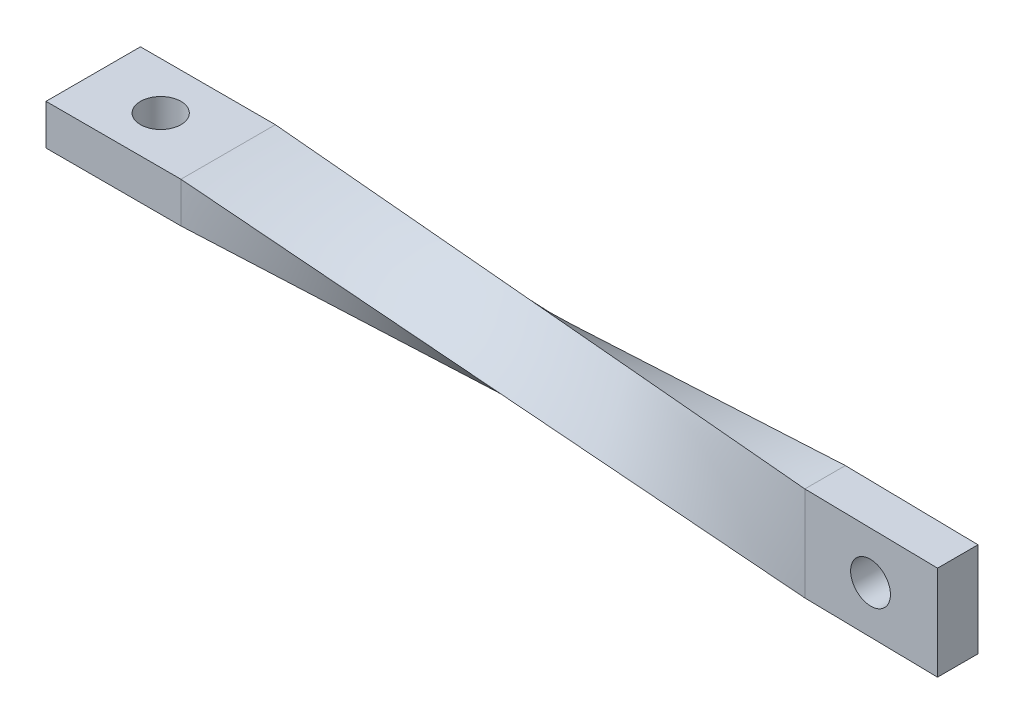
ISO-10303-21;
HEADER;
FILE_DESCRIPTION(('STEP AP214'),'2;1');
FILE_NAME('part.step','',(''),(''),'','','');
FILE_SCHEMA(('AUTOMOTIVE_DESIGN { 1 0 10303 214 1 1 1 1 }'));
ENDSEC;
DATA;
#1=APPLICATION_CONTEXT('core data for automotive mechanical design processes');
#2=APPLICATION_PROTOCOL_DEFINITION('international standard','automotive_design',2000,#1);
#3=PRODUCT_CONTEXT('',#1,'mechanical');
#4=PRODUCT('Part','Part','',(#3));
#5=PRODUCT_RELATED_PRODUCT_CATEGORY('part','',(#4));
#6=PRODUCT_DEFINITION_FORMATION('','',#4);
#7=PRODUCT_DEFINITION_CONTEXT('part definition',#1,'design');
#8=PRODUCT_DEFINITION('design','',#6,#7);
#9=PRODUCT_DEFINITION_SHAPE('','',#8);
#10=(LENGTH_UNIT() NAMED_UNIT(*) SI_UNIT(.MILLI.,.METRE.));
#11=(NAMED_UNIT(*) PLANE_ANGLE_UNIT() SI_UNIT($,.RADIAN.));
#12=(NAMED_UNIT(*) SI_UNIT($,.STERADIAN.) SOLID_ANGLE_UNIT());
#13=UNCERTAINTY_MEASURE_WITH_UNIT(LENGTH_MEASURE(1.E-05),#10,'distance_accuracy_value','');
#14=(GEOMETRIC_REPRESENTATION_CONTEXT(3) GLOBAL_UNCERTAINTY_ASSIGNED_CONTEXT((#13)) GLOBAL_UNIT_ASSIGNED_CONTEXT((#10,
#11,#12)) REPRESENTATION_CONTEXT('',''));
#15=CARTESIAN_POINT('',(0.,0.,0.));
#16=DIRECTION('',(0.,0.,1.));
#17=DIRECTION('',(1.,0.,0.));
#18=AXIS2_PLACEMENT_3D('',#15,#16,#17);
#19=CARTESIAN_POINT('',(54.9922111222972,0.,0.168288995891755));
#20=DIRECTION('',(1.,0.,0.));
#21=DIRECTION('',(0.,0.,-1.));
#22=AXIS2_PLACEMENT_3D('',#19,#20,#21);
#23=PLANE('',#22);
#24=DIRECTION('',(0.,0.,-1.));
#25=VECTOR('',#24,1.);
#26=CARTESIAN_POINT('',(54.9922111222973,3.5,2.42558947740465));
#27=LINE('',#26,#25);
#28=CARTESIAN_POINT('',(54.9922111222973,3.5,2.42558947740465));
#29=VERTEX_POINT('',#28);
#30=CARTESIAN_POINT('',(54.9922111222973,3.5,-0.57441052259535));
#31=VERTEX_POINT('',#30);
#32=EDGE_CURVE('E86',#29,#31,#27,.T.);
#33=ORIENTED_EDGE('',*,*,#32,.F.);
#34=DIRECTION('',(0.,-1.,0.));
#35=VECTOR('',#34,1.);
#36=CARTESIAN_POINT('',(54.9922111222973,3.5,2.42558947740465));
#37=LINE('',#36,#35);
#38=CARTESIAN_POINT('',(54.9922111222973,-3.5,2.42558947740465));
#39=VERTEX_POINT('',#38);
#40=EDGE_CURVE('E106',#29,#39,#37,.T.);
#41=ORIENTED_EDGE('',*,*,#40,.T.);
#42=DIRECTION('',(0.,0.,-1.));
#43=VECTOR('',#42,1.);
#44=CARTESIAN_POINT('',(54.9922111222973,-3.5,2.42558947740465));
#45=LINE('',#44,#43);
#46=CARTESIAN_POINT('',(54.9922111222973,-3.5,-0.57441052259535));
#47=VERTEX_POINT('',#46);
#48=EDGE_CURVE('E324',#39,#47,#45,.T.);
#49=ORIENTED_EDGE('',*,*,#48,.T.);
#50=DIRECTION('',(0.,-1.,0.));
#51=VECTOR('',#50,1.);
#52=CARTESIAN_POINT('',(54.9922111222973,3.5,-0.57441052259535));
#53=LINE('',#52,#51);
#54=EDGE_CURVE('E304',#31,#47,#53,.T.);
#55=ORIENTED_EDGE('',*,*,#54,.F.);
#56=EDGE_LOOP('',(#33,#41,#49,#55));
#57=FACE_BOUND('',#56,.T.);
#58=ADVANCED_FACE('F76',(#57),#23,.T.);
#59=CARTESIAN_POINT('',(44.9936272818796,3.5,2.2573004815129));
#60=DIRECTION('',(-0.0168288995891755,0.,0.999858384041769));
#61=DIRECTION('',(0.999858384041769,0.,0.0168288995891755));
#62=AXIS2_PLACEMENT_3D('',#59,#60,#61);
#63=PLANE('',#62);
#64=CARTESIAN_POINT('',(49.9424396530432,0.,2.34059534387463));
#65=DIRECTION('',(-0.0168288995891755,0.,0.999858384041769));
#66=DIRECTION('',(0.999858384041769,0.,0.0168288995891755));
#67=AXIS2_PLACEMENT_3D('',#64,#65,#66);
#68=CIRCLE('',#67,1.5);
#69=CARTESIAN_POINT('',(51.4422272291058,0.,2.36583869325839));
#70=VERTEX_POINT('',#69);
#71=EDGE_CURVE('E177',#70,#70,#68,.F.);
#72=ORIENTED_EDGE('',*,*,#71,.T.);
#73=EDGE_LOOP('',(#72));
#74=FACE_BOUND('',#73,.T.);
#75=ORIENTED_EDGE('',*,*,#40,.F.);
#76=DIRECTION('',(0.999858384041769,0.,0.0168288995891755));
#77=VECTOR('',#76,1.);
#78=CARTESIAN_POINT('',(44.9936272818796,3.5,2.2573004815129));
#79=LINE('',#78,#77);
#80=CARTESIAN_POINT('',(44.9936272818796,3.5,2.2573004815129));
#81=VERTEX_POINT('',#80);
#82=EDGE_CURVE('E295',#81,#29,#79,.T.);
#83=ORIENTED_EDGE('',*,*,#82,.F.);
#84=CARTESIAN_POINT('',(44.9936272818796,-3.5,2.2573004815129));
#85=CARTESIAN_POINT('',(44.9936272818796,-1.16666666666667,2.2573004815129));
#86=CARTESIAN_POINT('',(44.9936272818796,1.16666666666667,2.2573004815129));
#87=CARTESIAN_POINT('',(44.9936272818796,3.5,2.2573004815129));
#88=B_SPLINE_CURVE_WITH_KNOTS('',3,(#84,#85,#86,#87),.UNSPECIFIED.,.F.,.F.,(4,4),(0.,1.),.UNSPECIFIED.);
#89=CARTESIAN_POINT('',(44.9936272818796,-3.5,2.2573004815129));
#90=VERTEX_POINT('',#89);
#91=EDGE_CURVE('E297',#81,#90,#88,.F.);
#92=ORIENTED_EDGE('',*,*,#91,.T.);
#93=DIRECTION('',(0.999858384041769,0.,0.0168288995891755));
#94=VECTOR('',#93,1.);
#95=CARTESIAN_POINT('',(44.9936272818796,-3.5,2.2573004815129));
#96=LINE('',#95,#94);
#97=EDGE_CURVE('E326',#90,#39,#96,.T.);
#98=ORIENTED_EDGE('',*,*,#97,.T.);
#99=EDGE_LOOP('',(#75,#83,#92,#98));
#100=FACE_BOUND('',#99,.T.);
#101=ADVANCED_FACE('F211',(#74,#100),#63,.T.);
#102=CARTESIAN_POINT('',(44.9936272818796,-3.5,2.2573004815129));
#103=DIRECTION('',(0.,-1.,0.));
#104=DIRECTION('',(0.,0.,-1.));
#105=AXIS2_PLACEMENT_3D('',#102,#103,#104);
#106=PLANE('',#105);
#107=ORIENTED_EDGE('',*,*,#48,.F.);
#108=ORIENTED_EDGE('',*,*,#97,.F.);
#109=CARTESIAN_POINT('',(44.9936272818796,-3.5,-0.742699518487104));
#110=CARTESIAN_POINT('',(44.9936272818796,-3.5,0.257300481512896));
#111=CARTESIAN_POINT('',(44.9936272818796,-3.5,1.2573004815129));
#112=CARTESIAN_POINT('',(44.9936272818796,-3.5,2.2573004815129));
#113=B_SPLINE_CURVE_WITH_KNOTS('',3,(#109,#110,#111,#112),.UNSPECIFIED.,.F.,.F.,(4,4),(0.,1.),.UNSPECIFIED.);
#114=CARTESIAN_POINT('',(44.9936272818796,-3.5,-0.742699518487104));
#115=VERTEX_POINT('',#114);
#116=EDGE_CURVE('E321',#90,#115,#113,.F.);
#117=ORIENTED_EDGE('',*,*,#116,.T.);
#118=DIRECTION('',(0.999858384041769,0.,0.0168288995891755));
#119=VECTOR('',#118,1.);
#120=CARTESIAN_POINT('',(44.9936272818796,-3.5,-0.742699518487104));
#121=LINE('',#120,#119);
#122=EDGE_CURVE('E316',#115,#47,#121,.T.);
#123=ORIENTED_EDGE('',*,*,#122,.T.);
#124=EDGE_LOOP('',(#107,#108,#117,#123));
#125=FACE_BOUND('',#124,.T.);
#126=ADVANCED_FACE('F362',(#125),#106,.T.);
#127=CARTESIAN_POINT('',(44.9936272818796,3.5,2.2573004815129));
#128=DIRECTION('',(0.,-1.,0.));
#129=DIRECTION('',(0.,0.,-1.));
#130=AXIS2_PLACEMENT_3D('',#127,#128,#129);
#131=PLANE('',#130);
#132=ORIENTED_EDGE('',*,*,#32,.T.);
#133=DIRECTION('',(0.999858384041769,0.,0.0168288995891755));
#134=VECTOR('',#133,1.);
#135=CARTESIAN_POINT('',(44.9936272818796,3.5,-0.742699518487104));
#136=LINE('',#135,#134);
#137=CARTESIAN_POINT('',(44.9936272818796,3.5,-0.742699518487104));
#138=VERTEX_POINT('',#137);
#139=EDGE_CURVE('E300',#138,#31,#136,.T.);
#140=ORIENTED_EDGE('',*,*,#139,.F.);
#141=CARTESIAN_POINT('',(44.9936272818796,3.5,2.2573004815129));
#142=CARTESIAN_POINT('',(44.9936272818796,3.5,1.2573004815129));
#143=CARTESIAN_POINT('',(44.9936272818796,3.5,0.257300481512896));
#144=CARTESIAN_POINT('',(44.9936272818796,3.5,-0.742699518487104));
#145=B_SPLINE_CURVE_WITH_KNOTS('',3,(#141,#142,#143,#144),.UNSPECIFIED.,.F.,.F.,(4,4),(0.,1.),.UNSPECIFIED.);
#146=EDGE_CURVE('E13',#81,#138,#145,.T.);
#147=ORIENTED_EDGE('',*,*,#146,.F.);
#148=ORIENTED_EDGE('',*,*,#82,.T.);
#149=EDGE_LOOP('',(#132,#140,#147,#148));
#150=FACE_BOUND('',#149,.T.);
#151=ADVANCED_FACE('F352',(#150),#131,.F.);
#152=CARTESIAN_POINT('',(44.9936272818796,3.5,-0.742699518487104));
#153=DIRECTION('',(-0.0168288995891755,0.,0.999858384041769));
#154=DIRECTION('',(0.999858384041769,0.,0.0168288995891755));
#155=AXIS2_PLACEMENT_3D('',#152,#153,#154);
#156=PLANE('',#155);
#157=CARTESIAN_POINT('',(49.9929192020885,0.,-0.658555020541228));
#158=DIRECTION('',(0.0168288995891755,0.,-0.999858384041769));
#159=DIRECTION('',(-0.999858384041769,0.,-0.0168288995891755));
#160=AXIS2_PLACEMENT_3D('',#157,#158,#159);
#161=CIRCLE('',#160,1.5);
#162=CARTESIAN_POINT('',(48.4931316260258,0.,-0.683798369924991));
#163=VERTEX_POINT('',#162);
#164=EDGE_CURVE('E174',#163,#163,#161,.T.);
#165=ORIENTED_EDGE('',*,*,#164,.F.);
#166=EDGE_LOOP('',(#165));
#167=FACE_BOUND('',#166,.T.);
#168=ORIENTED_EDGE('',*,*,#54,.T.);
#169=ORIENTED_EDGE('',*,*,#122,.F.);
#170=CARTESIAN_POINT('',(44.9936272818796,3.5,-0.742699518487105));
#171=CARTESIAN_POINT('',(44.9936272818796,1.16666666666667,-0.742699518487105));
#172=CARTESIAN_POINT('',(44.9936272818796,-1.16666666666667,-0.742699518487105));
#173=CARTESIAN_POINT('',(44.9936272818796,-3.5,-0.742699518487105));
#174=B_SPLINE_CURVE_WITH_KNOTS('',3,(#170,#171,#172,#173),.UNSPECIFIED.,.F.,.F.,(4,4),(0.,1.),.UNSPECIFIED.);
#175=EDGE_CURVE('E303',#138,#115,#174,.T.);
#176=ORIENTED_EDGE('',*,*,#175,.F.);
#177=ORIENTED_EDGE('',*,*,#139,.T.);
#178=EDGE_LOOP('',(#168,#169,#176,#177));
#179=FACE_BOUND('',#178,.T.);
#180=ADVANCED_FACE('F361',(#167,#179),#156,.F.);
#181=CARTESIAN_POINT('',(0.,1.5,-3.5));
#182=CARTESIAN_POINT('',(14.9978757606265,2.16666666666667,-1.5808998394957));
#183=CARTESIAN_POINT('',(29.9957515212531,2.83333333333333,0.338200321008597));
#184=CARTESIAN_POINT('',(44.9936272818796,3.5,2.2573004815129));
#185=CARTESIAN_POINT('',(0.,1.5,-1.16666666666667));
#186=CARTESIAN_POINT('',(14.9978757606265,1.38888888888889,-0.0253442839401462));
#187=CARTESIAN_POINT('',(29.9957515212531,1.27777777777778,1.11597809878637));
#188=CARTESIAN_POINT('',(44.9936272818796,1.16666666666667,2.2573004815129));
#189=CARTESIAN_POINT('',(0.,1.5,1.16666666666667));
#190=CARTESIAN_POINT('',(14.9978757606265,0.611111111111111,1.53021127161541));
#191=CARTESIAN_POINT('',(29.9957515212531,-0.277777777777778,1.89375587656415));
#192=CARTESIAN_POINT('',(44.9936272818796,-1.16666666666667,2.2573004815129));
#193=CARTESIAN_POINT('',(0.,1.5,3.5));
#194=CARTESIAN_POINT('',(14.9978757606265,-0.166666666666667,3.08576682717097));
#195=CARTESIAN_POINT('',(29.9957515212531,-1.83333333333333,2.67153365434193));
#196=CARTESIAN_POINT('',(44.9936272818796,-3.5,2.2573004815129));
#197=B_SPLINE_SURFACE_WITH_KNOTS('',3,3,((#181,#182,#183,#184),(#185,#186,#187,#188),(#189,#190,
#191,#192),(#193,#194,#195,#196)),.UNSPECIFIED.,.F.,.F.,.F.,(4,4),(4,4),(0.,1.),(0.,1.),.UNSPECIFIED.);
#198=DIRECTION('',(0.,0.,1.));
#199=VECTOR('',#198,1.);
#200=CARTESIAN_POINT('',(0.,1.5,3.5));
#201=LINE('',#200,#199);
#202=CARTESIAN_POINT('',(0.,1.5,-3.5));
#203=VERTEX_POINT('',#202);
#204=CARTESIAN_POINT('',(0.,1.5,3.5));
#205=VERTEX_POINT('',#204);
#206=EDGE_CURVE('E289',#203,#205,#201,.T.);
#207=DIRECTION('',(0.993507769932282,-0.110405387379426,-0.0274401443469589));
#208=VECTOR('',#207,1.);
#209=CARTESIAN_POINT('',(22.4968136409398,-1.,2.87865024075645));
#210=LINE('',#209,#208);
#211=EDGE_CURVE('E94',#205,#90,#210,.T.);
#212=DIRECTION('',(-0.990949783292485,-0.044048450554311,-0.126800082793116));
#213=VECTOR('',#212,1.);
#214=CARTESIAN_POINT('',(22.4968136409398,2.5,-0.621349759243553));
#215=LINE('',#214,#213);
#216=EDGE_CURVE('E245',#81,#203,#215,.T.);
#217=ORIENTED_EDGE('',*,*,#206,.T.);
#218=ORIENTED_EDGE('',*,*,#211,.T.);
#219=ORIENTED_EDGE('',*,*,#91,.F.);
#220=ORIENTED_EDGE('',*,*,#216,.T.);
#221=EDGE_LOOP('',(#217,#218,#219,#220));
#222=FACE_BOUND('',#221,.T.);
#223=ADVANCED_FACE('F365',(#222),#197,.T.);
#224=CARTESIAN_POINT('',(0.,1.5,3.5));
#225=CARTESIAN_POINT('',(14.9978757606265,-0.166666666666667,3.08576682717097));
#226=CARTESIAN_POINT('',(29.9957515212531,-1.83333333333333,2.67153365434193));
#227=CARTESIAN_POINT('',(44.9936272818796,-3.5,2.2573004815129));
#228=CARTESIAN_POINT('',(0.,0.5,3.5));
#229=CARTESIAN_POINT('',(14.9978757606265,-0.833333333333333,2.75243349383763));
#230=CARTESIAN_POINT('',(29.9957515212531,-2.16666666666667,2.00486698767526));
#231=CARTESIAN_POINT('',(44.9936272818796,-3.5,1.2573004815129));
#232=CARTESIAN_POINT('',(0.,-0.5,3.5));
#233=CARTESIAN_POINT('',(14.9978757606265,-1.5,2.4191001605043));
#234=CARTESIAN_POINT('',(29.9957515212531,-2.5,1.3382003210086));
#235=CARTESIAN_POINT('',(44.9936272818796,-3.5,0.257300481512896));
#236=CARTESIAN_POINT('',(0.,-1.5,3.5));
#237=CARTESIAN_POINT('',(14.9978757606265,-2.16666666666667,2.08576682717097));
#238=CARTESIAN_POINT('',(29.9957515212531,-2.83333333333333,0.671533654341931));
#239=CARTESIAN_POINT('',(44.9936272818796,-3.5,-0.742699518487104));
#240=B_SPLINE_SURFACE_WITH_KNOTS('',3,3,((#224,#225,#226,#227),(#228,#229,#230,#231),(#232,#233,
#234,#235),(#236,#237,#238,#239)),.UNSPECIFIED.,.F.,.F.,.F.,(4,4),(4,4),(0.,1.),(0.,1.),.UNSPECIFIED.);
#241=DIRECTION('',(0.,-1.,0.));
#242=VECTOR('',#241,1.);
#243=CARTESIAN_POINT('',(0.,-1.5,3.5));
#244=LINE('',#243,#242);
#245=CARTESIAN_POINT('',(0.,-1.5,3.5));
#246=VERTEX_POINT('',#245);
#247=EDGE_CURVE('E79',#205,#246,#244,.T.);
#248=DIRECTION('',(0.994610130392804,-0.0442111556893021,-0.0937873244773802));
#249=VECTOR('',#248,1.);
#250=CARTESIAN_POINT('',(22.4968136409398,-2.5,1.37865024075645));
#251=LINE('',#250,#249);
#252=EDGE_CURVE('E192',#246,#115,#251,.T.);
#253=ORIENTED_EDGE('',*,*,#247,.T.);
#254=ORIENTED_EDGE('',*,*,#252,.T.);
#255=ORIENTED_EDGE('',*,*,#116,.F.);
#256=ORIENTED_EDGE('',*,*,#211,.F.);
#257=EDGE_LOOP('',(#253,#254,#255,#256));
#258=FACE_BOUND('',#257,.T.);
#259=ADVANCED_FACE('F408',(#258),#240,.T.);
#260=CARTESIAN_POINT('',(0.,-1.5,-3.5));
#261=CARTESIAN_POINT('',(14.9978757606265,0.166666666666667,-2.5808998394957));
#262=CARTESIAN_POINT('',(29.9957515212531,1.83333333333333,-1.6617996789914));
#263=CARTESIAN_POINT('',(44.9936272818796,3.5,-0.742699518487104));
#264=CARTESIAN_POINT('',(0.,-0.5,-3.5));
#265=CARTESIAN_POINT('',(14.9978757606265,0.833333333333333,-2.24756650616237));
#266=CARTESIAN_POINT('',(29.9957515212531,2.16666666666667,-0.995133012324736));
#267=CARTESIAN_POINT('',(44.9936272818796,3.5,0.257300481512896));
#268=CARTESIAN_POINT('',(0.,0.5,-3.5));
#269=CARTESIAN_POINT('',(14.9978757606265,1.5,-1.91423317282904));
#270=CARTESIAN_POINT('',(29.9957515212531,2.5,-0.32846634565807));
#271=CARTESIAN_POINT('',(44.9936272818796,3.5,1.2573004815129));
#272=CARTESIAN_POINT('',(0.,1.5,-3.5));
#273=CARTESIAN_POINT('',(14.9978757606265,2.16666666666667,-1.5808998394957));
#274=CARTESIAN_POINT('',(29.9957515212531,2.83333333333333,0.338200321008597));
#275=CARTESIAN_POINT('',(44.9936272818796,3.5,2.2573004815129));
#276=B_SPLINE_SURFACE_WITH_KNOTS('',3,3,((#260,#261,#262,#263),(#264,#265,#266,#267),(#268,#269,
#270,#271),(#272,#273,#274,#275)),.UNSPECIFIED.,.F.,.F.,.F.,(4,4),(4,4),(0.,1.),(0.,1.),.UNSPECIFIED.);
#277=DIRECTION('',(0.,1.,0.));
#278=VECTOR('',#277,1.);
#279=CARTESIAN_POINT('',(0.,-1.5,-3.5));
#280=LINE('',#279,#278);
#281=CARTESIAN_POINT('',(0.,-1.5,-3.5));
#282=VERTEX_POINT('',#281);
#283=EDGE_CURVE('E155',#282,#203,#280,.T.);
#284=DIRECTION('',(0.992043641541254,0.11024268340561,0.0607944408075124));
#285=VECTOR('',#284,1.);
#286=CARTESIAN_POINT('',(22.4968136409398,1.,-2.12134975924355));
#287=LINE('',#286,#285);
#288=EDGE_CURVE('E311',#282,#138,#287,.T.);
#289=ORIENTED_EDGE('',*,*,#283,.T.);
#290=ORIENTED_EDGE('',*,*,#216,.F.);
#291=ORIENTED_EDGE('',*,*,#146,.T.);
#292=ORIENTED_EDGE('',*,*,#288,.F.);
#293=EDGE_LOOP('',(#289,#290,#291,#292));
#294=FACE_BOUND('',#293,.T.);
#295=ADVANCED_FACE('F206',(#294),#276,.T.);
#296=CARTESIAN_POINT('',(0.,-1.5,3.5));
#297=CARTESIAN_POINT('',(14.9978757606265,-2.16666666666667,2.08576682717097));
#298=CARTESIAN_POINT('',(29.9957515212531,-2.83333333333333,0.671533654341931));
#299=CARTESIAN_POINT('',(44.9936272818796,-3.5,-0.742699518487105));
#300=CARTESIAN_POINT('',(0.,-1.5,1.16666666666667));
#301=CARTESIAN_POINT('',(14.9978757606265,-1.38888888888889,0.53021127161541));
#302=CARTESIAN_POINT('',(29.9957515212531,-1.27777777777778,-0.106244123435847));
#303=CARTESIAN_POINT('',(44.9936272818796,-1.16666666666667,-0.742699518487105));
#304=CARTESIAN_POINT('',(0.,-1.5,-1.16666666666667));
#305=CARTESIAN_POINT('',(14.9978757606265,-0.611111111111111,-1.02534428394015));
#306=CARTESIAN_POINT('',(29.9957515212531,0.277777777777778,-0.884021901213625));
#307=CARTESIAN_POINT('',(44.9936272818796,1.16666666666667,-0.742699518487105));
#308=CARTESIAN_POINT('',(0.,-1.5,-3.5));
#309=CARTESIAN_POINT('',(14.9978757606265,0.166666666666667,-2.5808998394957));
#310=CARTESIAN_POINT('',(29.9957515212531,1.83333333333333,-1.6617996789914));
#311=CARTESIAN_POINT('',(44.9936272818796,3.5,-0.742699518487105));
#312=B_SPLINE_SURFACE_WITH_KNOTS('',3,3,((#296,#297,#298,#299),(#300,#301,#302,#303),(#304,#305,
#306,#307),(#308,#309,#310,#311)),.UNSPECIFIED.,.F.,.F.,.F.,(4,4),(4,4),(0.,1.),(0.,1.),.UNSPECIFIED.);
#313=DIRECTION('',(0.,0.,-1.));
#314=VECTOR('',#313,1.);
#315=CARTESIAN_POINT('',(0.,-1.5,3.5));
#316=LINE('',#315,#314);
#317=EDGE_CURVE('E187',#246,#282,#316,.T.);
#318=ORIENTED_EDGE('',*,*,#317,.T.);
#319=ORIENTED_EDGE('',*,*,#288,.T.);
#320=ORIENTED_EDGE('',*,*,#175,.T.);
#321=ORIENTED_EDGE('',*,*,#252,.F.);
#322=EDGE_LOOP('',(#318,#319,#320,#321));
#323=FACE_BOUND('',#322,.T.);
#324=ADVANCED_FACE('F194',(#323),#312,.T.);
#325=CARTESIAN_POINT('',(-10.,-1.5,3.5));
#326=DIRECTION('',(0.,-1.,0.));
#327=DIRECTION('',(0.,0.,-1.));
#328=AXIS2_PLACEMENT_3D('',#325,#326,#327);
#329=PLANE('',#328);
#330=CARTESIAN_POINT('',(-5.,-1.5,0.));
#331=DIRECTION('',(0.,-1.,0.));
#332=DIRECTION('',(0.,0.,-1.));
#333=AXIS2_PLACEMENT_3D('',#330,#331,#332);
#334=CIRCLE('',#333,1.5);
#335=CARTESIAN_POINT('',(-5.,-1.5,-1.5));
#336=VERTEX_POINT('',#335);
#337=EDGE_CURVE('E577',#336,#336,#334,.T.);
#338=ORIENTED_EDGE('',*,*,#337,.F.);
#339=EDGE_LOOP('',(#338));
#340=FACE_BOUND('',#339,.T.);
#341=ORIENTED_EDGE('',*,*,#317,.F.);
#342=DIRECTION('',(1.,0.,0.));
#343=VECTOR('',#342,1.);
#344=CARTESIAN_POINT('',(-10.,-1.5,3.5));
#345=LINE('',#344,#343);
#346=CARTESIAN_POINT('',(-10.,-1.5,3.5));
#347=VERTEX_POINT('',#346);
#348=EDGE_CURVE('E172',#347,#246,#345,.T.);
#349=ORIENTED_EDGE('',*,*,#348,.F.);
#350=DIRECTION('',(0.,0.,-1.));
#351=VECTOR('',#350,1.);
#352=CARTESIAN_POINT('',(-10.,-1.5,3.5));
#353=LINE('',#352,#351);
#354=CARTESIAN_POINT('',(-10.,-1.5,-3.5));
#355=VERTEX_POINT('',#354);
#356=EDGE_CURVE('E166',#347,#355,#353,.T.);
#357=ORIENTED_EDGE('',*,*,#356,.T.);
#358=DIRECTION('',(1.,0.,0.));
#359=VECTOR('',#358,1.);
#360=CARTESIAN_POINT('',(-10.,-1.5,-3.5));
#361=LINE('',#360,#359);
#362=EDGE_CURVE('E150',#355,#282,#361,.T.);
#363=ORIENTED_EDGE('',*,*,#362,.T.);
#364=EDGE_LOOP('',(#341,#349,#357,#363));
#365=FACE_BOUND('',#364,.T.);
#366=ADVANCED_FACE('F171',(#340,#365),#329,.T.);
#367=CARTESIAN_POINT('',(-10.,-1.5,3.5));
#368=DIRECTION('',(0.,0.,-1.));
#369=DIRECTION('',(-1.,0.,0.));
#370=AXIS2_PLACEMENT_3D('',#367,#368,#369);
#371=PLANE('',#370);
#372=ORIENTED_EDGE('',*,*,#247,.F.);
#373=DIRECTION('',(1.,0.,0.));
#374=VECTOR('',#373,1.);
#375=CARTESIAN_POINT('',(-10.,1.5,3.5));
#376=LINE('',#375,#374);
#377=CARTESIAN_POINT('',(-10.,1.5,3.5));
#378=VERTEX_POINT('',#377);
#379=EDGE_CURVE('E286',#378,#205,#376,.T.);
#380=ORIENTED_EDGE('',*,*,#379,.F.);
#381=DIRECTION('',(0.,1.,0.));
#382=VECTOR('',#381,1.);
#383=CARTESIAN_POINT('',(-10.,-1.5,3.5));
#384=LINE('',#383,#382);
#385=EDGE_CURVE('E161',#347,#378,#384,.T.);
#386=ORIENTED_EDGE('',*,*,#385,.F.);
#387=ORIENTED_EDGE('',*,*,#348,.T.);
#388=EDGE_LOOP('',(#372,#380,#386,#387));
#389=FACE_BOUND('',#388,.T.);
#390=ADVANCED_FACE('F255',(#389),#371,.F.);
#391=CARTESIAN_POINT('',(-10.,1.5,3.5));
#392=DIRECTION('',(0.,-1.,0.));
#393=DIRECTION('',(0.,0.,-1.));
#394=AXIS2_PLACEMENT_3D('',#391,#392,#393);
#395=PLANE('',#394);
#396=CARTESIAN_POINT('',(-5.,1.5,0.));
#397=DIRECTION('',(0.,-1.,0.));
#398=DIRECTION('',(0.,0.,-1.));
#399=AXIS2_PLACEMENT_3D('',#396,#397,#398);
#400=CIRCLE('',#399,1.5);
#401=CARTESIAN_POINT('',(-5.,1.5,-1.5));
#402=VERTEX_POINT('',#401);
#403=EDGE_CURVE('E580',#402,#402,#400,.F.);
#404=ORIENTED_EDGE('',*,*,#403,.F.);
#405=EDGE_LOOP('',(#404));
#406=FACE_BOUND('',#405,.T.);
#407=ORIENTED_EDGE('',*,*,#206,.F.);
#408=DIRECTION('',(1.,0.,0.));
#409=VECTOR('',#408,1.);
#410=CARTESIAN_POINT('',(-10.,1.5,-3.5));
#411=LINE('',#410,#409);
#412=CARTESIAN_POINT('',(-10.,1.5,-3.5));
#413=VERTEX_POINT('',#412);
#414=EDGE_CURVE('E160',#413,#203,#411,.T.);
#415=ORIENTED_EDGE('',*,*,#414,.F.);
#416=DIRECTION('',(0.,0.,-1.));
#417=VECTOR('',#416,1.);
#418=CARTESIAN_POINT('',(-10.,1.5,3.5));
#419=LINE('',#418,#417);
#420=EDGE_CURVE('E168',#378,#413,#419,.T.);
#421=ORIENTED_EDGE('',*,*,#420,.F.);
#422=ORIENTED_EDGE('',*,*,#379,.T.);
#423=EDGE_LOOP('',(#407,#415,#421,#422));
#424=FACE_BOUND('',#423,.T.);
#425=ADVANCED_FACE('F265',(#406,#424),#395,.F.);
#426=CARTESIAN_POINT('',(-10.,-1.5,-3.5));
#427=DIRECTION('',(0.,0.,-1.));
#428=DIRECTION('',(-1.,0.,0.));
#429=AXIS2_PLACEMENT_3D('',#426,#427,#428);
#430=PLANE('',#429);
#431=ORIENTED_EDGE('',*,*,#283,.F.);
#432=ORIENTED_EDGE('',*,*,#362,.F.);
#433=DIRECTION('',(0.,1.,0.));
#434=VECTOR('',#433,1.);
#435=CARTESIAN_POINT('',(-10.,-1.5,-3.5));
#436=LINE('',#435,#434);
#437=EDGE_CURVE('E153',#355,#413,#436,.T.);
#438=ORIENTED_EDGE('',*,*,#437,.T.);
#439=ORIENTED_EDGE('',*,*,#414,.T.);
#440=EDGE_LOOP('',(#431,#432,#438,#439));
#441=FACE_BOUND('',#440,.T.);
#442=ADVANCED_FACE('F152',(#441),#430,.T.);
#443=CARTESIAN_POINT('',(-10.,0.,0.));
#444=DIRECTION('',(1.,0.,0.));
#445=DIRECTION('',(0.,0.,-1.));
#446=AXIS2_PLACEMENT_3D('',#443,#444,#445);
#447=PLANE('',#446);
#448=ORIENTED_EDGE('',*,*,#356,.F.);
#449=ORIENTED_EDGE('',*,*,#385,.T.);
#450=ORIENTED_EDGE('',*,*,#420,.T.);
#451=ORIENTED_EDGE('',*,*,#437,.F.);
#452=EDGE_LOOP('',(#448,#449,#450,#451));
#453=FACE_BOUND('',#452,.T.);
#454=ADVANCED_FACE('F165',(#453),#447,.F.);
#455=CARTESIAN_POINT('',(49.9059357022723,0.,4.50941101928242));
#456=DIRECTION('',(0.0168288995891755,0.,-0.999858384041769));
#457=DIRECTION('',(-0.999858384041769,0.,-0.0168288995891755));
#458=AXIS2_PLACEMENT_3D('',#455,#456,#457);
#459=CYLINDRICAL_SURFACE('',#458,1.5);
#460=ORIENTED_EDGE('',*,*,#71,.F.);
#461=EDGE_LOOP('',(#460));
#462=FACE_BOUND('',#461,.T.);
#463=ORIENTED_EDGE('',*,*,#164,.T.);
#464=EDGE_LOOP('',(#463));
#465=FACE_BOUND('',#464,.T.);
#466=ADVANCED_FACE('F538',(#462,#465),#459,.F.);
#467=CARTESIAN_POINT('',(-5.,3.50110307764067,0.));
#468=DIRECTION('',(0.,-1.,0.));
#469=DIRECTION('',(0.,0.,-1.));
#470=AXIS2_PLACEMENT_3D('',#467,#468,#469);
#471=CYLINDRICAL_SURFACE('',#470,1.5);
#472=ORIENTED_EDGE('',*,*,#337,.T.);
#473=EDGE_LOOP('',(#472));
#474=FACE_BOUND('',#473,.T.);
#475=ORIENTED_EDGE('',*,*,#403,.T.);
#476=EDGE_LOOP('',(#475));
#477=FACE_BOUND('',#476,.T.);
#478=ADVANCED_FACE('F557',(#474,#477),#471,.F.);
#479=CLOSED_SHELL('',(#58,#101,#126,#151,#180,#223,#259,#295,#324,#366,#390,#425,#442,#454,#466,#478));
#480=MANIFOLD_SOLID_BREP('B2',#479);
#481=ADVANCED_BREP_SHAPE_REPRESENTATION('',(#18,#480),#14);
#482=SHAPE_DEFINITION_REPRESENTATION(#9,#481);
ENDSEC;
END-ISO-10303-21;
